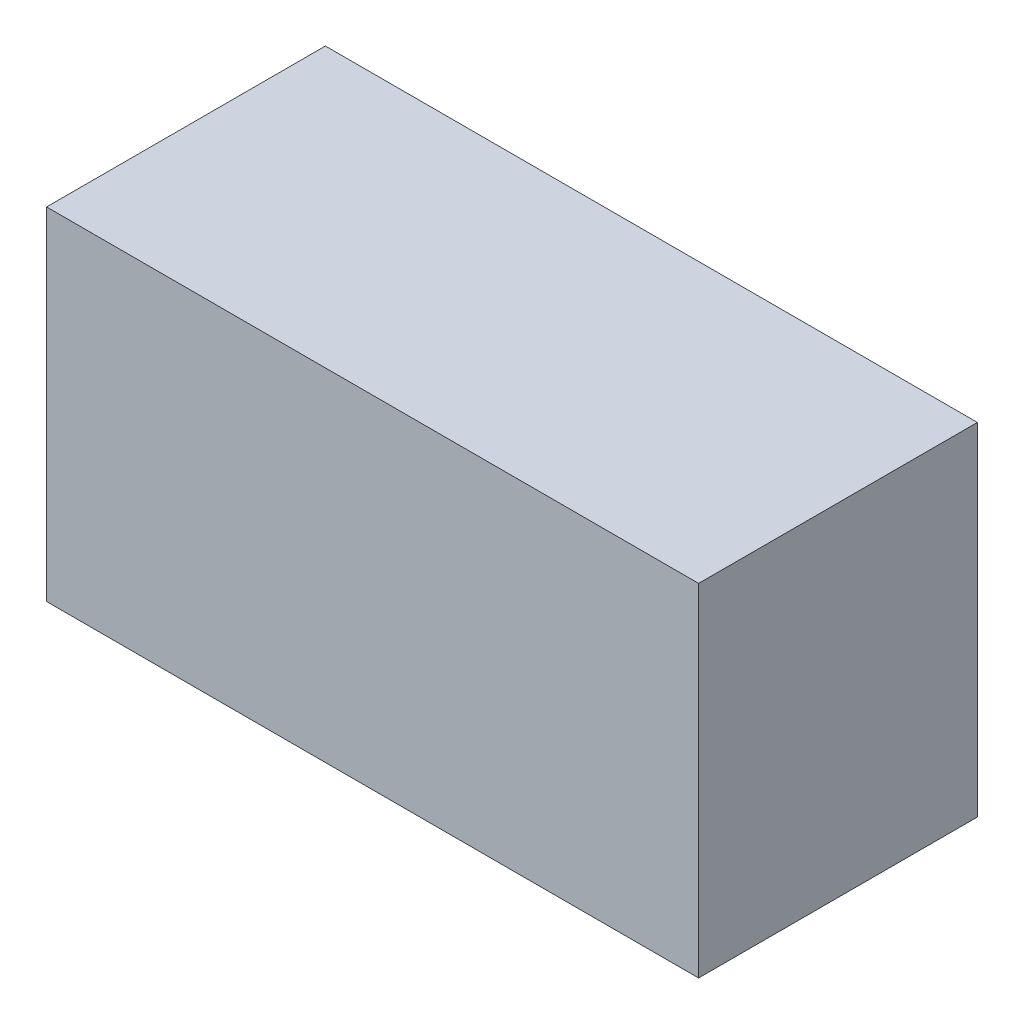
ISO-10303-21;
HEADER;
FILE_DESCRIPTION(('STEP AP214'),'2;1');
FILE_NAME('part.step','',(''),(''),'','','');
FILE_SCHEMA(('AUTOMOTIVE_DESIGN { 1 0 10303 214 1 1 1 1 }'));
ENDSEC;
DATA;
#1=APPLICATION_CONTEXT('core data for automotive mechanical design processes');
#2=APPLICATION_PROTOCOL_DEFINITION('international standard','automotive_design',2000,#1);
#3=PRODUCT_CONTEXT('',#1,'mechanical');
#4=PRODUCT('Part','Part','',(#3));
#5=PRODUCT_RELATED_PRODUCT_CATEGORY('part','',(#4));
#6=PRODUCT_DEFINITION_FORMATION('','',#4);
#7=PRODUCT_DEFINITION_CONTEXT('part definition',#1,'design');
#8=PRODUCT_DEFINITION('design','',#6,#7);
#9=PRODUCT_DEFINITION_SHAPE('','',#8);
#10=(LENGTH_UNIT() NAMED_UNIT(*) SI_UNIT(.MILLI.,.METRE.));
#11=(NAMED_UNIT(*) PLANE_ANGLE_UNIT() SI_UNIT($,.RADIAN.));
#12=(NAMED_UNIT(*) SI_UNIT($,.STERADIAN.) SOLID_ANGLE_UNIT());
#13=UNCERTAINTY_MEASURE_WITH_UNIT(LENGTH_MEASURE(1.E-05),#10,'distance_accuracy_value','');
#14=(GEOMETRIC_REPRESENTATION_CONTEXT(3) GLOBAL_UNCERTAINTY_ASSIGNED_CONTEXT((#13)) GLOBAL_UNIT_ASSIGNED_CONTEXT((#10,
#11,#12)) REPRESENTATION_CONTEXT('',''));
#15=CARTESIAN_POINT('',(0.,0.,0.));
#16=DIRECTION('',(0.,0.,1.));
#17=DIRECTION('',(1.,0.,0.));
#18=AXIS2_PLACEMENT_3D('',#15,#16,#17);
#19=CARTESIAN_POINT('',(-0.0125,-0.19,0.32));
#20=DIRECTION('',(0.,0.,1.));
#21=DIRECTION('',(1.,0.,0.));
#22=AXIS2_PLACEMENT_3D('',#19,#20,#21);
#23=PLANE('',#22);
#24=DIRECTION('',(0.,1.,0.));
#25=VECTOR('',#24,1.);
#26=CARTESIAN_POINT('',(0.7125,-0.19,0.32));
#27=LINE('',#26,#25);
#28=CARTESIAN_POINT('',(0.7125,0.19,0.32));
#29=VERTEX_POINT('',#28);
#30=CARTESIAN_POINT('',(0.7125,-0.19,0.32));
#31=VERTEX_POINT('',#30);
#32=EDGE_CURVE('E75',#29,#31,#27,.F.);
#33=ORIENTED_EDGE('',*,*,#32,.F.);
#34=DIRECTION('',(1.,0.,0.));
#35=VECTOR('',#34,1.);
#36=CARTESIAN_POINT('',(-0.0125,0.19,0.32));
#37=LINE('',#36,#35);
#38=CARTESIAN_POINT('',(-0.0125,0.19,0.32));
#39=VERTEX_POINT('',#38);
#40=EDGE_CURVE('E57',#39,#29,#37,.T.);
#41=ORIENTED_EDGE('',*,*,#40,.F.);
#42=DIRECTION('',(0.,1.,0.));
#43=VECTOR('',#42,1.);
#44=CARTESIAN_POINT('',(-0.0125,-0.19,0.32));
#45=LINE('',#44,#43);
#46=CARTESIAN_POINT('',(-0.0125,-0.19,0.32));
#47=VERTEX_POINT('',#46);
#48=EDGE_CURVE('E19',#39,#47,#45,.F.);
#49=ORIENTED_EDGE('',*,*,#48,.T.);
#50=DIRECTION('',(1.,0.,0.));
#51=VECTOR('',#50,1.);
#52=CARTESIAN_POINT('',(-0.0125,-0.19,0.32));
#53=LINE('',#52,#51);
#54=EDGE_CURVE('E54',#47,#31,#53,.T.);
#55=ORIENTED_EDGE('',*,*,#54,.T.);
#56=EDGE_LOOP('',(#33,#41,#49,#55));
#57=FACE_BOUND('',#56,.T.);
#58=ADVANCED_FACE('F16',(#57),#23,.T.);
#59=CARTESIAN_POINT('',(-0.0125,-0.19,0.01));
#60=DIRECTION('',(1.,0.,0.));
#61=DIRECTION('',(0.,0.,-1.));
#62=AXIS2_PLACEMENT_3D('',#59,#60,#61);
#63=PLANE('',#62);
#64=DIRECTION('',(0.,0.,1.));
#65=VECTOR('',#64,1.);
#66=CARTESIAN_POINT('',(-0.0125,0.19,0.01));
#67=LINE('',#66,#65);
#68=CARTESIAN_POINT('',(-0.0125,0.19,0.01));
#69=VERTEX_POINT('',#68);
#70=EDGE_CURVE('E77',#69,#39,#67,.T.);
#71=ORIENTED_EDGE('',*,*,#70,.F.);
#72=DIRECTION('',(0.,1.,0.));
#73=VECTOR('',#72,1.);
#74=CARTESIAN_POINT('',(-0.0125,-0.19,0.01));
#75=LINE('',#74,#73);
#76=CARTESIAN_POINT('',(-0.0125,-0.19,0.01));
#77=VERTEX_POINT('',#76);
#78=EDGE_CURVE('E72',#69,#77,#75,.F.);
#79=ORIENTED_EDGE('',*,*,#78,.T.);
#80=DIRECTION('',(0.,0.,1.));
#81=VECTOR('',#80,1.);
#82=CARTESIAN_POINT('',(-0.0125,-0.19,0.01));
#83=LINE('',#82,#81);
#84=EDGE_CURVE('E62',#77,#47,#83,.T.);
#85=ORIENTED_EDGE('',*,*,#84,.T.);
#86=ORIENTED_EDGE('',*,*,#48,.F.);
#87=EDGE_LOOP('',(#71,#79,#85,#86));
#88=FACE_BOUND('',#87,.T.);
#89=ADVANCED_FACE('F71',(#88),#63,.F.);
#90=CARTESIAN_POINT('',(-0.0125,-0.19,0.01));
#91=DIRECTION('',(0.,1.,0.));
#92=DIRECTION('',(0.,0.,1.));
#93=AXIS2_PLACEMENT_3D('',#90,#91,#92);
#94=PLANE('',#93);
#95=ORIENTED_EDGE('',*,*,#54,.F.);
#96=ORIENTED_EDGE('',*,*,#84,.F.);
#97=DIRECTION('',(1.,0.,0.));
#98=VECTOR('',#97,1.);
#99=CARTESIAN_POINT('',(-0.0125,-0.19,0.01));
#100=LINE('',#99,#98);
#101=CARTESIAN_POINT('',(0.7125,-0.19,0.01));
#102=VERTEX_POINT('',#101);
#103=EDGE_CURVE('E82',#77,#102,#100,.T.);
#104=ORIENTED_EDGE('',*,*,#103,.T.);
#105=DIRECTION('',(0.,0.,-1.));
#106=VECTOR('',#105,1.);
#107=CARTESIAN_POINT('',(0.7125,-0.19,0.01));
#108=LINE('',#107,#106);
#109=EDGE_CURVE('E68',#31,#102,#108,.T.);
#110=ORIENTED_EDGE('',*,*,#109,.F.);
#111=EDGE_LOOP('',(#95,#96,#104,#110));
#112=FACE_BOUND('',#111,.T.);
#113=ADVANCED_FACE('F65',(#112),#94,.F.);
#114=CARTESIAN_POINT('',(0.7125,-0.19,0.01));
#115=DIRECTION('',(1.,0.,0.));
#116=DIRECTION('',(0.,0.,-1.));
#117=AXIS2_PLACEMENT_3D('',#114,#115,#116);
#118=PLANE('',#117);
#119=DIRECTION('',(0.,0.,1.));
#120=VECTOR('',#119,1.);
#121=CARTESIAN_POINT('',(0.7125,0.19,0.01));
#122=LINE('',#121,#120);
#123=CARTESIAN_POINT('',(0.7125,0.19,0.01));
#124=VERTEX_POINT('',#123);
#125=EDGE_CURVE('E33',#29,#124,#122,.F.);
#126=ORIENTED_EDGE('',*,*,#125,.F.);
#127=ORIENTED_EDGE('',*,*,#32,.T.);
#128=ORIENTED_EDGE('',*,*,#109,.T.);
#129=DIRECTION('',(0.,1.,0.));
#130=VECTOR('',#129,1.);
#131=CARTESIAN_POINT('',(0.7125,-0.19,0.01));
#132=LINE('',#131,#130);
#133=EDGE_CURVE('E25',#102,#124,#132,.T.);
#134=ORIENTED_EDGE('',*,*,#133,.T.);
#135=EDGE_LOOP('',(#126,#127,#128,#134));
#136=FACE_BOUND('',#135,.T.);
#137=ADVANCED_FACE('F87',(#136),#118,.T.);
#138=CARTESIAN_POINT('',(-0.0125,0.19,0.01));
#139=DIRECTION('',(0.,1.,0.));
#140=DIRECTION('',(0.,0.,1.));
#141=AXIS2_PLACEMENT_3D('',#138,#139,#140);
#142=PLANE('',#141);
#143=ORIENTED_EDGE('',*,*,#40,.T.);
#144=ORIENTED_EDGE('',*,*,#125,.T.);
#145=DIRECTION('',(1.,0.,0.));
#146=VECTOR('',#145,1.);
#147=CARTESIAN_POINT('',(-0.0125,0.19,0.01));
#148=LINE('',#147,#146);
#149=EDGE_CURVE('E11',#124,#69,#148,.F.);
#150=ORIENTED_EDGE('',*,*,#149,.T.);
#151=ORIENTED_EDGE('',*,*,#70,.T.);
#152=EDGE_LOOP('',(#143,#144,#150,#151));
#153=FACE_BOUND('',#152,.T.);
#154=ADVANCED_FACE('F90',(#153),#142,.T.);
#155=CARTESIAN_POINT('',(-0.0125,-0.19,0.01));
#156=DIRECTION('',(0.,0.,1.));
#157=DIRECTION('',(1.,0.,0.));
#158=AXIS2_PLACEMENT_3D('',#155,#156,#157);
#159=PLANE('',#158);
#160=ORIENTED_EDGE('',*,*,#133,.F.);
#161=ORIENTED_EDGE('',*,*,#103,.F.);
#162=ORIENTED_EDGE('',*,*,#78,.F.);
#163=ORIENTED_EDGE('',*,*,#149,.F.);
#164=EDGE_LOOP('',(#160,#161,#162,#163));
#165=FACE_BOUND('',#164,.T.);
#166=ADVANCED_FACE('F89',(#165),#159,.F.);
#167=CLOSED_SHELL('',(#58,#89,#113,#137,#154,#166));
#168=MANIFOLD_SOLID_BREP('B1',#167);
#169=ADVANCED_BREP_SHAPE_REPRESENTATION('',(#18,#168),#14);
#170=SHAPE_DEFINITION_REPRESENTATION(#9,#169);
ENDSEC;
END-ISO-10303-21;
